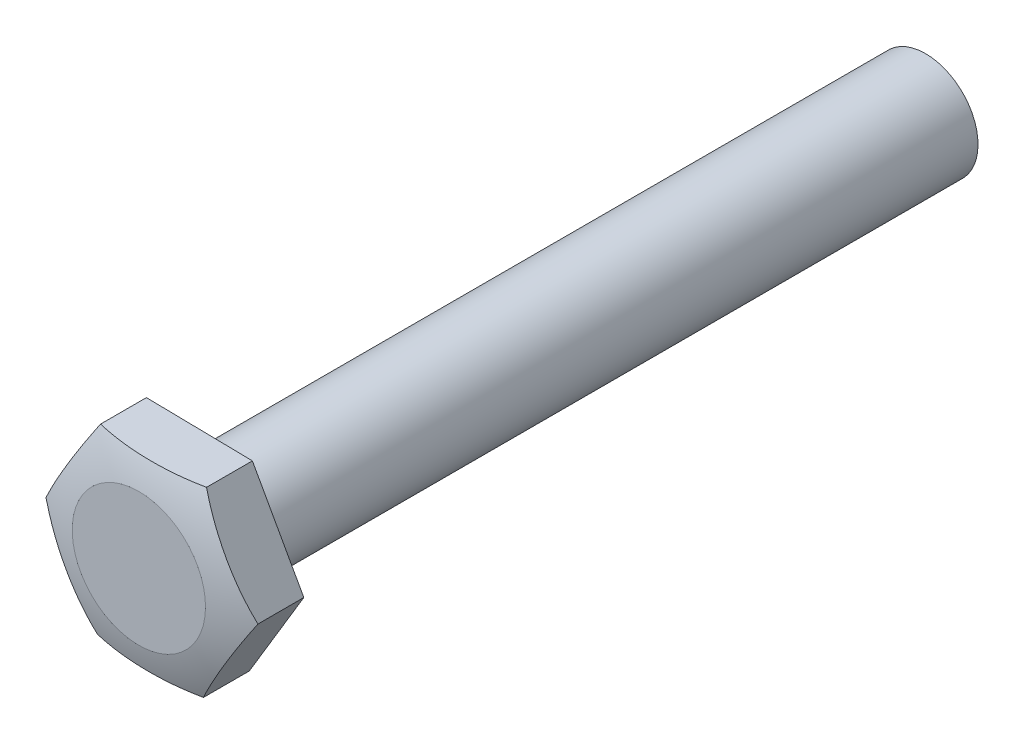
ISO-10303-21;
HEADER;
FILE_DESCRIPTION(('STEP AP214'),'2;1');
FILE_NAME('part.step','',(''),(''),'','','');
FILE_SCHEMA(('AUTOMOTIVE_DESIGN { 1 0 10303 214 1 1 1 1 }'));
ENDSEC;
DATA;
#1=APPLICATION_CONTEXT('core data for automotive mechanical design processes');
#2=APPLICATION_PROTOCOL_DEFINITION('international standard','automotive_design',2000,#1);
#3=PRODUCT_CONTEXT('',#1,'mechanical');
#4=PRODUCT('Part','Part','',(#3));
#5=PRODUCT_RELATED_PRODUCT_CATEGORY('part','',(#4));
#6=PRODUCT_DEFINITION_FORMATION('','',#4);
#7=PRODUCT_DEFINITION_CONTEXT('part definition',#1,'design');
#8=PRODUCT_DEFINITION('design','',#6,#7);
#9=PRODUCT_DEFINITION_SHAPE('','',#8);
#10=(LENGTH_UNIT() NAMED_UNIT(*) SI_UNIT(.MILLI.,.METRE.));
#11=(NAMED_UNIT(*) PLANE_ANGLE_UNIT() SI_UNIT($,.RADIAN.));
#12=(NAMED_UNIT(*) SI_UNIT($,.STERADIAN.) SOLID_ANGLE_UNIT());
#13=UNCERTAINTY_MEASURE_WITH_UNIT(LENGTH_MEASURE(1.E-05),#10,'distance_accuracy_value','');
#14=(GEOMETRIC_REPRESENTATION_CONTEXT(3) GLOBAL_UNCERTAINTY_ASSIGNED_CONTEXT((#13)) GLOBAL_UNIT_ASSIGNED_CONTEXT((#10,
#11,#12)) REPRESENTATION_CONTEXT('',''));
#15=CARTESIAN_POINT('',(0.,0.,0.));
#16=DIRECTION('',(0.,0.,1.));
#17=DIRECTION('',(1.,0.,0.));
#18=AXIS2_PLACEMENT_3D('',#15,#16,#17);
#19=CARTESIAN_POINT('',(0.,0.,12.0620950460362));
#20=DIRECTION('',(0.,0.,-1.));
#21=DIRECTION('',(-0.999858335888688,0.0168317602734835,0.));
#22=AXIS2_PLACEMENT_3D('',#19,#20,#21);
#23=DEGENERATE_TOROIDAL_SURFACE('',#22,1.60360211733348,15.825120832035,.T.);
#24=CARTESIAN_POINT('',(0.,0.,27.5));
#25=DIRECTION('',(0.,0.,-1.));
#26=DIRECTION('',(-0.999858335888688,0.0168317602734835,0.));
#27=AXIS2_PLACEMENT_3D('',#24,#25,#26);
#28=CIRCLE('',#27,5.08290376865477);
#29=CARTESIAN_POINT('',(5.08218370360949,-0.085554217727182,27.5));
#30=VERTEX_POINT('',#29);
#31=EDGE_CURVE('E11',#30,#30,#28,.T.);
#32=ORIENTED_EDGE('',*,*,#31,.T.);
#33=EDGE_LOOP('',(#32));
#34=FACE_BOUND('',#33,.T.);
#35=CARTESIAN_POINT('',(-8.08175871127556,0.136049498547634,26.5));
#36=CARTESIAN_POINT('',(-7.07881509280343,1.80757737245835,26.9374014168299));
#37=CARTESIAN_POINT('',(-6.00832019100014,3.59168769958662,26.9386953781707));
#38=CARTESIAN_POINT('',(-4.93195093486305,5.38558835473465,26.9399964401407));
#39=CARTESIAN_POINT('',(-3.9230570337234,7.06703310049462,26.5));
#40=B_SPLINE_CURVE_WITH_KNOTS('',2,(#35,#36,#37,#38,#39),.UNSPECIFIED.,.F.,.F.,(3,2,3),(0.,0.5,
1.),.UNSPECIFIED.);
#41=CARTESIAN_POINT('',(-8.08175871127556,0.136049498547633,26.5));
#42=VERTEX_POINT('',#41);
#43=CARTESIAN_POINT('',(-3.9230570337234,7.06703310049463,26.5));
#44=VERTEX_POINT('',#43);
#45=EDGE_CURVE('E116',#42,#44,#40,.T.);
#46=ORIENTED_EDGE('',*,*,#45,.F.);
#47=CARTESIAN_POINT('',(-4.15870167755217,-6.93098360194699,26.5));
#48=CARTESIAN_POINT('',(-5.10481547022683,-5.22664501288487,26.9374014168161));
#49=CARTESIAN_POINT('',(-6.11465288580218,-3.40751406968378,26.9386953781707));
#50=CARTESIAN_POINT('',(-7.13003179692763,-1.57840062249607,26.9399964401544));
#51=CARTESIAN_POINT('',(-8.08175871127556,0.136049498547635,26.5));
#52=B_SPLINE_CURVE_WITH_KNOTS('',2,(#47,#48,#49,#50,#51),.UNSPECIFIED.,.F.,.F.,(3,2,3),(0.,0.5,
1.),.UNSPECIFIED.);
#53=CARTESIAN_POINT('',(-4.15870167755217,-6.93098360194699,26.5));
#54=VERTEX_POINT('',#53);
#55=EDGE_CURVE('E252',#54,#42,#52,.T.);
#56=ORIENTED_EDGE('',*,*,#55,.F.);
#57=CARTESIAN_POINT('',(3.9230570337234,-7.06703310049462,26.5));
#58=CARTESIAN_POINT('',(1.95893089537894,-7.0339687161505,26.9407830938268));
#59=CARTESIAN_POINT('',(-0.13766114735573,-6.99867438155535,26.9386885989549));
#60=CARTESIAN_POINT('',(-2.21314769402152,-6.96373533994275,26.9366151884678));
#61=CARTESIAN_POINT('',(-4.15870167755217,-6.93098360194699,26.5));
#62=B_SPLINE_CURVE_WITH_KNOTS('',2,(#57,#58,#59,#60,#61),.UNSPECIFIED.,.F.,.F.,(3,2,3),(0.,0.5,
1.),.UNSPECIFIED.);
#63=CARTESIAN_POINT('',(3.9230570337234,-7.06703310049463,26.5));
#64=VERTEX_POINT('',#63);
#65=EDGE_CURVE('E236',#64,#54,#62,.T.);
#66=ORIENTED_EDGE('',*,*,#65,.F.);
#67=CARTESIAN_POINT('',(8.08175871127555,-0.136049498547624,26.5));
#68=CARTESIAN_POINT('',(7.07881509285072,-1.80757737237952,26.9374014168093));
#69=CARTESIAN_POINT('',(6.00832019100014,-3.59168769958661,26.9386953781707));
#70=CARTESIAN_POINT('',(4.93195093491035,-5.38558835465581,26.9399964401613));
#71=CARTESIAN_POINT('',(3.92305703372339,-7.06703310049462,26.5));
#72=B_SPLINE_CURVE_WITH_KNOTS('',2,(#67,#68,#69,#70,#71),.UNSPECIFIED.,.F.,.F.,(3,2,3),(0.,0.5,
1.),.UNSPECIFIED.);
#73=CARTESIAN_POINT('',(8.08175871127556,-0.136049498547623,26.5));
#74=VERTEX_POINT('',#73);
#75=EDGE_CURVE('E174',#74,#64,#72,.T.);
#76=ORIENTED_EDGE('',*,*,#75,.F.);
#77=CARTESIAN_POINT('',(4.15870167755216,6.93098360194701,26.5));
#78=CARTESIAN_POINT('',(5.10481547022683,5.22664501288487,26.9374014168161));
#79=CARTESIAN_POINT('',(6.11465288580217,3.40751406968379,26.9386953781707));
#80=CARTESIAN_POINT('',(7.13003179692765,1.57840062249604,26.9399964401544));
#81=CARTESIAN_POINT('',(8.08175871127555,-0.136049498547617,26.5));
#82=B_SPLINE_CURVE_WITH_KNOTS('',2,(#77,#78,#79,#80,#81),.UNSPECIFIED.,.F.,.F.,(3,2,3),(0.,0.5,
1.),.UNSPECIFIED.);
#83=CARTESIAN_POINT('',(4.15870167755215,6.930983601947,26.5));
#84=VERTEX_POINT('',#83);
#85=EDGE_CURVE('E221',#84,#74,#82,.T.);
#86=ORIENTED_EDGE('',*,*,#85,.F.);
#87=CARTESIAN_POINT('',(-3.9230570337234,7.06703310049463,26.5));
#88=CARTESIAN_POINT('',(-1.95893089540726,7.03396871615099,26.9407830938205));
#89=CARTESIAN_POINT('',(0.13766114735743,6.99867438155533,26.9386885989549));
#90=CARTESIAN_POINT('',(2.21314769399316,6.96373533994324,26.9366151884741));
#91=CARTESIAN_POINT('',(4.15870167755216,6.930983601947,26.5));
#92=B_SPLINE_CURVE_WITH_KNOTS('',2,(#87,#88,#89,#90,#91),.UNSPECIFIED.,.F.,.F.,(3,2,3),(0.,0.5,
1.),.UNSPECIFIED.);
#93=EDGE_CURVE('E119',#44,#84,#92,.T.);
#94=ORIENTED_EDGE('',*,*,#93,.F.);
#95=EDGE_LOOP('',(#46,#56,#66,#76,#86,#94));
#96=FACE_BOUND('',#95,.T.);
#97=ADVANCED_FACE('F16',(#34,#96),#23,.T.);
#98=CARTESIAN_POINT('',(0.,0.,-32.5));
#99=DIRECTION('',(0.,0.,1.));
#100=DIRECTION('',(0.999858335888688,-0.0168317602734835,0.));
#101=AXIS2_PLACEMENT_3D('',#98,#99,#100);
#102=CYLINDRICAL_SURFACE('',#101,4.);
#103=CARTESIAN_POINT('',(0.,0.,-32.5));
#104=DIRECTION('',(0.,0.,-1.));
#105=DIRECTION('',(-0.999858335888688,0.0168317602734835,0.));
#106=AXIS2_PLACEMENT_3D('',#103,#104,#105);
#107=CIRCLE('',#106,4.);
#108=CARTESIAN_POINT('',(3.99943334355475,-0.067327041093934,-32.5));
#109=VERTEX_POINT('',#108);
#110=EDGE_CURVE('E292',#109,#109,#107,.T.);
#111=ORIENTED_EDGE('',*,*,#110,.F.);
#112=EDGE_LOOP('',(#111));
#113=FACE_BOUND('',#112,.T.);
#114=CARTESIAN_POINT('',(0.,0.,23.));
#115=DIRECTION('',(0.,0.,-1.));
#116=DIRECTION('',(-0.999858335888688,0.0168317602734835,0.));
#117=AXIS2_PLACEMENT_3D('',#114,#115,#116);
#118=CIRCLE('',#117,4.);
#119=CARTESIAN_POINT('',(3.99943334355475,-0.067327041093934,23.));
#120=VERTEX_POINT('',#119);
#121=EDGE_CURVE('E29',#120,#120,#118,.T.);
#122=ORIENTED_EDGE('',*,*,#121,.T.);
#123=EDGE_LOOP('',(#122));
#124=FACE_BOUND('',#123,.T.);
#125=ADVANCED_FACE('F190',(#113,#124),#102,.T.);
#126=CARTESIAN_POINT('',(0.,0.,-32.5));
#127=DIRECTION('',(0.,0.,-1.));
#128=DIRECTION('',(-0.999858335888688,0.0168317602734835,0.));
#129=AXIS2_PLACEMENT_3D('',#126,#127,#128);
#130=PLANE('',#129);
#131=ORIENTED_EDGE('',*,*,#110,.T.);
#132=EDGE_LOOP('',(#131));
#133=FACE_BOUND('',#132,.T.);
#134=ADVANCED_FACE('F192',(#133),#130,.T.);
#135=CARTESIAN_POINT('',(0.,0.,23.));
#136=DIRECTION('',(0.,0.,-1.));
#137=DIRECTION('',(-0.999858335888688,0.0168317602734835,0.));
#138=AXIS2_PLACEMENT_3D('',#135,#136,#137);
#139=PLANE('',#138);
#140=DIRECTION('',(-0.485352435957098,0.874318599201979,0.));
#141=VECTOR('',#140,1.);
#142=CARTESIAN_POINT('',(-4.15870167755217,-6.93098360194699,23.));
#143=LINE('',#142,#141);
#144=CARTESIAN_POINT('',(-4.15870167755217,-6.93098360194699,23.));
#145=VERTEX_POINT('',#144);
#146=CARTESIAN_POINT('',(-8.08175871127556,0.136049498547635,23.));
#147=VERTEX_POINT('',#146);
#148=EDGE_CURVE('E108',#145,#147,#143,.T.);
#149=ORIENTED_EDGE('',*,*,#148,.T.);
#150=DIRECTION('',(0.514505899931591,0.857486838928495,0.));
#151=VECTOR('',#150,1.);
#152=CARTESIAN_POINT('',(-8.08175871127556,0.136049498547635,23.));
#153=LINE('',#152,#151);
#154=CARTESIAN_POINT('',(-3.92305703372339,7.06703310049463,23.));
#155=VERTEX_POINT('',#154);
#156=EDGE_CURVE('E101',#147,#155,#153,.T.);
#157=ORIENTED_EDGE('',*,*,#156,.T.);
#158=DIRECTION('',(0.999858335888688,-0.0168317602734835,0.));
#159=VECTOR('',#158,1.);
#160=CARTESIAN_POINT('',(-3.92305703372339,7.06703310049463,23.));
#161=LINE('',#160,#159);
#162=CARTESIAN_POINT('',(4.15870167755216,6.930983601947,23.));
#163=VERTEX_POINT('',#162);
#164=EDGE_CURVE('E90',#155,#163,#161,.T.);
#165=ORIENTED_EDGE('',*,*,#164,.T.);
#166=DIRECTION('',(0.485352435957098,-0.874318599201979,0.));
#167=VECTOR('',#166,1.);
#168=CARTESIAN_POINT('',(4.15870167755216,6.930983601947,23.));
#169=LINE('',#168,#167);
#170=CARTESIAN_POINT('',(8.08175871127555,-0.136049498547632,23.));
#171=VERTEX_POINT('',#170);
#172=EDGE_CURVE('E102',#163,#171,#169,.T.);
#173=ORIENTED_EDGE('',*,*,#172,.T.);
#174=DIRECTION('',(-0.514505899931591,-0.857486838928495,0.));
#175=VECTOR('',#174,1.);
#176=CARTESIAN_POINT('',(8.08175871127555,-0.136049498547632,23.));
#177=LINE('',#176,#175);
#178=CARTESIAN_POINT('',(3.92305703372339,-7.06703310049462,23.));
#179=VERTEX_POINT('',#178);
#180=EDGE_CURVE('E264',#171,#179,#177,.T.);
#181=ORIENTED_EDGE('',*,*,#180,.T.);
#182=DIRECTION('',(-0.999858335888688,0.0168317602734836,0.));
#183=VECTOR('',#182,1.);
#184=CARTESIAN_POINT('',(3.92305703372339,-7.06703310049462,23.));
#185=LINE('',#184,#183);
#186=EDGE_CURVE('E258',#179,#145,#185,.T.);
#187=ORIENTED_EDGE('',*,*,#186,.T.);
#188=EDGE_LOOP('',(#149,#157,#165,#173,#181,#187));
#189=FACE_BOUND('',#188,.T.);
#190=ORIENTED_EDGE('',*,*,#121,.F.);
#191=EDGE_LOOP('',(#190));
#192=FACE_BOUND('',#191,.T.);
#193=ADVANCED_FACE('F105',(#189,#192),#139,.T.);
#194=CARTESIAN_POINT('',(-4.15870167755217,-6.93098360194699,23.));
#195=DIRECTION('',(0.874318599201979,0.485352435957098,0.));
#196=DIRECTION('',(0.,0.,-1.));
#197=AXIS2_PLACEMENT_3D('',#194,#195,#196);
#198=PLANE('',#197);
#199=DIRECTION('',(0.,0.,1.));
#200=VECTOR('',#199,1.);
#201=CARTESIAN_POINT('',(-4.15870167755217,-6.93098360194699,23.));
#202=LINE('',#201,#200);
#203=EDGE_CURVE('E249',#145,#54,#202,.T.);
#204=ORIENTED_EDGE('',*,*,#203,.T.);
#205=ORIENTED_EDGE('',*,*,#55,.T.);
#206=DIRECTION('',(0.,0.,1.));
#207=VECTOR('',#206,1.);
#208=CARTESIAN_POINT('',(-8.08175871127556,0.136049498547635,23.));
#209=LINE('',#208,#207);
#210=EDGE_CURVE('E125',#147,#42,#209,.T.);
#211=ORIENTED_EDGE('',*,*,#210,.F.);
#212=ORIENTED_EDGE('',*,*,#148,.F.);
#213=EDGE_LOOP('',(#204,#205,#211,#212));
#214=FACE_BOUND('',#213,.T.);
#215=ADVANCED_FACE('F256',(#214),#198,.F.);
#216=CARTESIAN_POINT('',(-8.08175871127556,0.136049498547635,23.));
#217=DIRECTION('',(0.857486838928496,-0.514505899931591,0.));
#218=DIRECTION('',(0.514505899931591,0.857486838928496,0.));
#219=AXIS2_PLACEMENT_3D('',#216,#217,#218);
#220=PLANE('',#219);
#221=ORIENTED_EDGE('',*,*,#210,.T.);
#222=ORIENTED_EDGE('',*,*,#45,.T.);
#223=DIRECTION('',(0.,0.,1.));
#224=VECTOR('',#223,1.);
#225=CARTESIAN_POINT('',(-3.92305703372339,7.06703310049463,23.));
#226=LINE('',#225,#224);
#227=EDGE_CURVE('E95',#155,#44,#226,.T.);
#228=ORIENTED_EDGE('',*,*,#227,.F.);
#229=ORIENTED_EDGE('',*,*,#156,.F.);
#230=EDGE_LOOP('',(#221,#222,#228,#229));
#231=FACE_BOUND('',#230,.T.);
#232=ADVANCED_FACE('F115',(#231),#220,.F.);
#233=CARTESIAN_POINT('',(-3.92305703372339,7.06703310049463,23.));
#234=DIRECTION('',(-0.0168317602734835,-0.999858335888688,0.));
#235=DIRECTION('',(0.,0.,1.));
#236=AXIS2_PLACEMENT_3D('',#233,#234,#235);
#237=PLANE('',#236);
#238=ORIENTED_EDGE('',*,*,#227,.T.);
#239=ORIENTED_EDGE('',*,*,#93,.T.);
#240=DIRECTION('',(0.,0.,1.));
#241=VECTOR('',#240,1.);
#242=CARTESIAN_POINT('',(4.15870167755216,6.930983601947,23.));
#243=LINE('',#242,#241);
#244=EDGE_CURVE('E97',#163,#84,#243,.T.);
#245=ORIENTED_EDGE('',*,*,#244,.F.);
#246=ORIENTED_EDGE('',*,*,#164,.F.);
#247=EDGE_LOOP('',(#238,#239,#245,#246));
#248=FACE_BOUND('',#247,.T.);
#249=ADVANCED_FACE('F92',(#248),#237,.F.);
#250=CARTESIAN_POINT('',(4.15870167755216,6.930983601947,23.));
#251=DIRECTION('',(-0.874318599201979,-0.485352435957098,0.));
#252=DIRECTION('',(0.,0.,1.));
#253=AXIS2_PLACEMENT_3D('',#250,#251,#252);
#254=PLANE('',#253);
#255=ORIENTED_EDGE('',*,*,#244,.T.);
#256=ORIENTED_EDGE('',*,*,#85,.T.);
#257=DIRECTION('',(0.,0.,1.));
#258=VECTOR('',#257,1.);
#259=CARTESIAN_POINT('',(8.08175871127555,-0.136049498547632,23.));
#260=LINE('',#259,#258);
#261=EDGE_CURVE('E213',#171,#74,#260,.T.);
#262=ORIENTED_EDGE('',*,*,#261,.F.);
#263=ORIENTED_EDGE('',*,*,#172,.F.);
#264=EDGE_LOOP('',(#255,#256,#262,#263));
#265=FACE_BOUND('',#264,.T.);
#266=ADVANCED_FACE('F150',(#265),#254,.F.);
#267=CARTESIAN_POINT('',(8.08175871127555,-0.136049498547632,23.));
#268=DIRECTION('',(-0.857486838928496,0.514505899931591,0.));
#269=DIRECTION('',(0.,0.,1.));
#270=AXIS2_PLACEMENT_3D('',#267,#268,#269);
#271=PLANE('',#270);
#272=ORIENTED_EDGE('',*,*,#261,.T.);
#273=ORIENTED_EDGE('',*,*,#75,.T.);
#274=DIRECTION('',(0.,0.,1.));
#275=VECTOR('',#274,1.);
#276=CARTESIAN_POINT('',(3.92305703372339,-7.06703310049462,23.));
#277=LINE('',#276,#275);
#278=EDGE_CURVE('E179',#179,#64,#277,.T.);
#279=ORIENTED_EDGE('',*,*,#278,.F.);
#280=ORIENTED_EDGE('',*,*,#180,.F.);
#281=EDGE_LOOP('',(#272,#273,#279,#280));
#282=FACE_BOUND('',#281,.T.);
#283=ADVANCED_FACE('F154',(#282),#271,.F.);
#284=CARTESIAN_POINT('',(3.92305703372339,-7.06703310049462,23.));
#285=DIRECTION('',(0.0168317602734835,0.999858335888688,0.));
#286=DIRECTION('',(-0.999858335888688,0.0168317602734835,0.));
#287=AXIS2_PLACEMENT_3D('',#284,#285,#286);
#288=PLANE('',#287);
#289=ORIENTED_EDGE('',*,*,#278,.T.);
#290=ORIENTED_EDGE('',*,*,#65,.T.);
#291=ORIENTED_EDGE('',*,*,#203,.F.);
#292=ORIENTED_EDGE('',*,*,#186,.F.);
#293=EDGE_LOOP('',(#289,#290,#291,#292));
#294=FACE_BOUND('',#293,.T.);
#295=ADVANCED_FACE('F151',(#294),#288,.F.);
#296=CARTESIAN_POINT('',(0.,0.,27.5));
#297=DIRECTION('',(0.,0.,-1.));
#298=DIRECTION('',(-0.999858335888688,0.0168317602734835,0.));
#299=AXIS2_PLACEMENT_3D('',#296,#297,#298);
#300=PLANE('',#299);
#301=ORIENTED_EDGE('',*,*,#31,.F.);
#302=EDGE_LOOP('',(#301));
#303=FACE_BOUND('',#302,.T.);
#304=ADVANCED_FACE('F18',(#303),#300,.F.);
#305=CLOSED_SHELL('',(#97,#125,#134,#193,#215,#232,#249,#266,#283,#295,#304));
#306=MANIFOLD_SOLID_BREP('B1',#305);
#307=ADVANCED_BREP_SHAPE_REPRESENTATION('',(#18,#306),#14);
#308=SHAPE_DEFINITION_REPRESENTATION(#9,#307);
ENDSEC;
END-ISO-10303-21;
